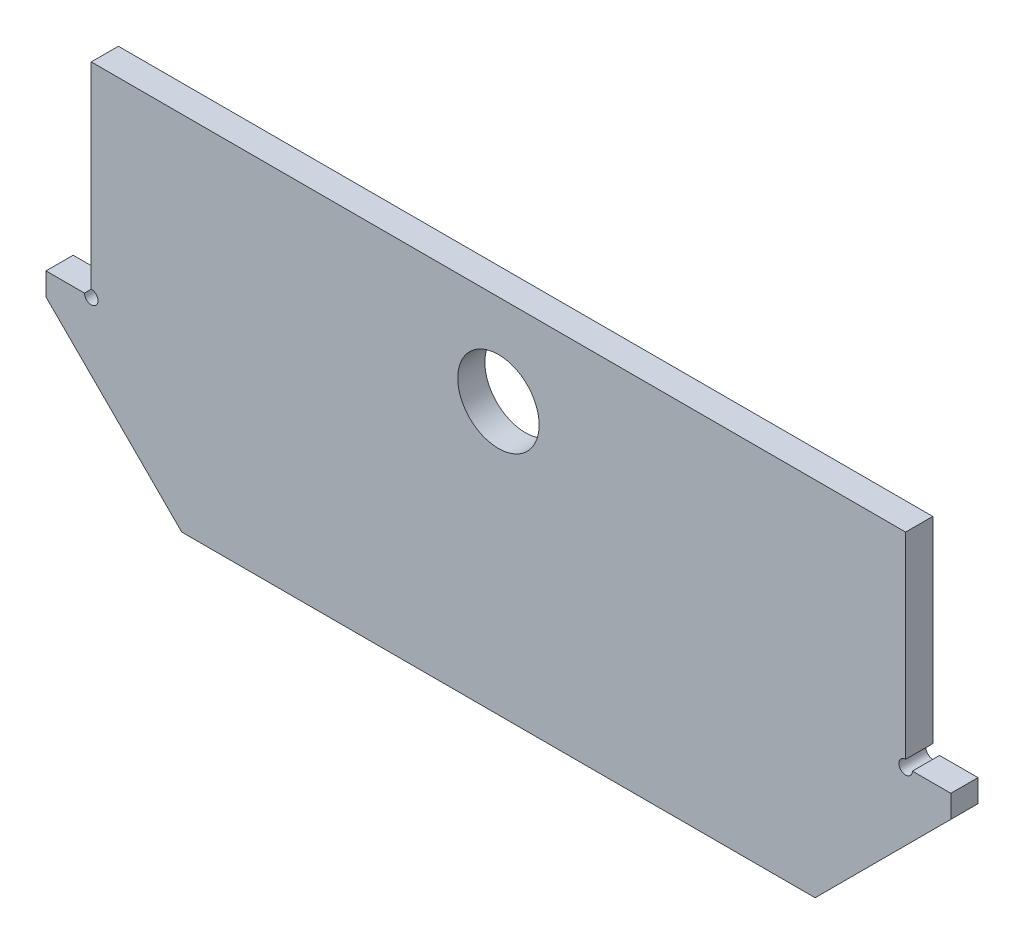
ISO-10303-21;
HEADER;
FILE_DESCRIPTION(('STEP AP214'),'2;1');
FILE_NAME('part.step','',(''),(''),'','','');
FILE_SCHEMA(('AUTOMOTIVE_DESIGN { 1 0 10303 214 1 1 1 1 }'));
ENDSEC;
DATA;
#1=APPLICATION_CONTEXT('core data for automotive mechanical design processes');
#2=APPLICATION_PROTOCOL_DEFINITION('international standard','automotive_design',2000,#1);
#3=PRODUCT_CONTEXT('',#1,'mechanical');
#4=PRODUCT('Part','Part','',(#3));
#5=PRODUCT_RELATED_PRODUCT_CATEGORY('part','',(#4));
#6=PRODUCT_DEFINITION_FORMATION('','',#4);
#7=PRODUCT_DEFINITION_CONTEXT('part definition',#1,'design');
#8=PRODUCT_DEFINITION('design','',#6,#7);
#9=PRODUCT_DEFINITION_SHAPE('','',#8);
#10=(LENGTH_UNIT() NAMED_UNIT(*) SI_UNIT(.MILLI.,.METRE.));
#11=(NAMED_UNIT(*) PLANE_ANGLE_UNIT() SI_UNIT($,.RADIAN.));
#12=(NAMED_UNIT(*) SI_UNIT($,.STERADIAN.) SOLID_ANGLE_UNIT());
#13=UNCERTAINTY_MEASURE_WITH_UNIT(LENGTH_MEASURE(1.E-05),#10,'distance_accuracy_value','');
#14=(GEOMETRIC_REPRESENTATION_CONTEXT(3) GLOBAL_UNCERTAINTY_ASSIGNED_CONTEXT((#13)) GLOBAL_UNIT_ASSIGNED_CONTEXT((#10,
#11,#12)) REPRESENTATION_CONTEXT('',''));
#15=CARTESIAN_POINT('',(0.,0.,0.));
#16=DIRECTION('',(0.,0.,1.));
#17=DIRECTION('',(1.,0.,0.));
#18=AXIS2_PLACEMENT_3D('',#15,#16,#17);
#19=CARTESIAN_POINT('',(-99.9999999999998,-1414.,-3.));
#20=DIRECTION('',(0.,1.,0.));
#21=DIRECTION('',(0.,0.,1.));
#22=AXIS2_PLACEMENT_3D('',#19,#20,#21);
#23=PLANE('',#22);
#24=DIRECTION('',(0.,0.,1.));
#25=VECTOR('',#24,1.);
#26=CARTESIAN_POINT('',(-91.4999999999998,-1414.,-3.));
#27=LINE('',#26,#25);
#28=CARTESIAN_POINT('',(-91.4999999999998,-1414.,-3.));
#29=VERTEX_POINT('',#28);
#30=CARTESIAN_POINT('',(-91.4999999999998,-1414.,3.));
#31=VERTEX_POINT('',#30);
#32=EDGE_CURVE('E60',#29,#31,#27,.T.);
#33=ORIENTED_EDGE('',*,*,#32,.F.);
#34=DIRECTION('',(-1.,0.,0.));
#35=VECTOR('',#34,1.);
#36=CARTESIAN_POINT('',(-99.9999999999998,-1414.,-3.));
#37=LINE('',#36,#35);
#38=CARTESIAN_POINT('',(-99.9999999999998,-1414.,-3.));
#39=VERTEX_POINT('',#38);
#40=EDGE_CURVE('E245',#29,#39,#37,.T.);
#41=ORIENTED_EDGE('',*,*,#40,.T.);
#42=DIRECTION('',(0.,0.,1.));
#43=VECTOR('',#42,1.);
#44=CARTESIAN_POINT('',(-99.9999999999998,-1414.,-3.));
#45=LINE('',#44,#43);
#46=CARTESIAN_POINT('',(-99.9999999999998,-1414.,3.));
#47=VERTEX_POINT('',#46);
#48=EDGE_CURVE('E168',#39,#47,#45,.T.);
#49=ORIENTED_EDGE('',*,*,#48,.T.);
#50=DIRECTION('',(-1.,0.,0.));
#51=VECTOR('',#50,1.);
#52=CARTESIAN_POINT('',(-99.9999999999998,-1414.,3.));
#53=LINE('',#52,#51);
#54=EDGE_CURVE('E196',#31,#47,#53,.T.);
#55=ORIENTED_EDGE('',*,*,#54,.F.);
#56=EDGE_LOOP('',(#33,#41,#49,#55));
#57=FACE_BOUND('',#56,.T.);
#58=ADVANCED_FACE('F38',(#57),#23,.T.);
#59=CARTESIAN_POINT('',(-90.,-1414.,-3.));
#60=DIRECTION('',(-1.,0.,0.));
#61=DIRECTION('',(0.,0.,1.));
#62=AXIS2_PLACEMENT_3D('',#59,#60,#61);
#63=PLANE('',#62);
#64=DIRECTION('',(0.,0.,1.));
#65=VECTOR('',#64,1.);
#66=CARTESIAN_POINT('',(-90.,-1412.5,-3.));
#67=LINE('',#66,#65);
#68=CARTESIAN_POINT('',(-90.,-1412.5,3.));
#69=VERTEX_POINT('',#68);
#70=CARTESIAN_POINT('',(-90.,-1412.5,-3.));
#71=VERTEX_POINT('',#70);
#72=EDGE_CURVE('E205',#69,#71,#67,.F.);
#73=ORIENTED_EDGE('',*,*,#72,.F.);
#74=DIRECTION('',(0.,-1.,0.));
#75=VECTOR('',#74,1.);
#76=CARTESIAN_POINT('',(-90.,-1414.,3.));
#77=LINE('',#76,#75);
#78=CARTESIAN_POINT('',(-90.,-1369.,3.));
#79=VERTEX_POINT('',#78);
#80=EDGE_CURVE('E228',#79,#69,#77,.T.);
#81=ORIENTED_EDGE('',*,*,#80,.F.);
#82=DIRECTION('',(0.,0.,1.));
#83=VECTOR('',#82,1.);
#84=CARTESIAN_POINT('',(-90.,-1369.,-3.));
#85=LINE('',#84,#83);
#86=CARTESIAN_POINT('',(-90.,-1369.,-3.));
#87=VERTEX_POINT('',#86);
#88=EDGE_CURVE('E169',#87,#79,#85,.T.);
#89=ORIENTED_EDGE('',*,*,#88,.F.);
#90=DIRECTION('',(0.,-1.,0.));
#91=VECTOR('',#90,1.);
#92=CARTESIAN_POINT('',(-90.,-1414.,-3.));
#93=LINE('',#92,#91);
#94=EDGE_CURVE('E164',#87,#71,#93,.T.);
#95=ORIENTED_EDGE('',*,*,#94,.T.);
#96=EDGE_LOOP('',(#73,#81,#89,#95));
#97=FACE_BOUND('',#96,.T.);
#98=ADVANCED_FACE('F299',(#97),#63,.T.);
#99=CARTESIAN_POINT('',(-90.,-1369.,-3.));
#100=DIRECTION('',(0.,1.,0.));
#101=DIRECTION('',(0.,0.,1.));
#102=AXIS2_PLACEMENT_3D('',#99,#100,#101);
#103=PLANE('',#102);
#104=ORIENTED_EDGE('',*,*,#88,.T.);
#105=DIRECTION('',(-1.,0.,0.));
#106=VECTOR('',#105,1.);
#107=CARTESIAN_POINT('',(-90.,-1369.,3.));
#108=LINE('',#107,#106);
#109=CARTESIAN_POINT('',(90.0000000000003,-1369.,3.));
#110=VERTEX_POINT('',#109);
#111=EDGE_CURVE('E202',#110,#79,#108,.T.);
#112=ORIENTED_EDGE('',*,*,#111,.F.);
#113=DIRECTION('',(0.,0.,1.));
#114=VECTOR('',#113,1.);
#115=CARTESIAN_POINT('',(90.0000000000003,-1369.,-3.));
#116=LINE('',#115,#114);
#117=CARTESIAN_POINT('',(90.0000000000003,-1369.,-3.));
#118=VERTEX_POINT('',#117);
#119=EDGE_CURVE('E172',#118,#110,#116,.T.);
#120=ORIENTED_EDGE('',*,*,#119,.F.);
#121=DIRECTION('',(-1.,0.,0.));
#122=VECTOR('',#121,1.);
#123=CARTESIAN_POINT('',(-90.,-1369.,-3.));
#124=LINE('',#123,#122);
#125=EDGE_CURVE('E154',#118,#87,#124,.T.);
#126=ORIENTED_EDGE('',*,*,#125,.T.);
#127=EDGE_LOOP('',(#104,#112,#120,#126));
#128=FACE_BOUND('',#127,.T.);
#129=ADVANCED_FACE('F303',(#128),#103,.T.);
#130=CARTESIAN_POINT('',(90.0000000000003,-1414.,-3.));
#131=DIRECTION('',(1.,0.,0.));
#132=DIRECTION('',(0.,0.,-1.));
#133=AXIS2_PLACEMENT_3D('',#130,#131,#132);
#134=PLANE('',#133);
#135=DIRECTION('',(0.,0.,1.));
#136=VECTOR('',#135,1.);
#137=CARTESIAN_POINT('',(90.0000000000003,-1412.5,-3.));
#138=LINE('',#137,#136);
#139=CARTESIAN_POINT('',(90.0000000000003,-1412.5,-3.));
#140=VERTEX_POINT('',#139);
#141=CARTESIAN_POINT('',(90.0000000000003,-1412.5,3.));
#142=VERTEX_POINT('',#141);
#143=EDGE_CURVE('E53',#140,#142,#138,.T.);
#144=ORIENTED_EDGE('',*,*,#143,.F.);
#145=DIRECTION('',(0.,1.,0.));
#146=VECTOR('',#145,1.);
#147=CARTESIAN_POINT('',(90.0000000000003,-1414.,-3.));
#148=LINE('',#147,#146);
#149=EDGE_CURVE('E144',#140,#118,#148,.T.);
#150=ORIENTED_EDGE('',*,*,#149,.T.);
#151=ORIENTED_EDGE('',*,*,#119,.T.);
#152=DIRECTION('',(0.,1.,0.));
#153=VECTOR('',#152,1.);
#154=CARTESIAN_POINT('',(90.0000000000003,-1414.,3.));
#155=LINE('',#154,#153);
#156=EDGE_CURVE('E200',#142,#110,#155,.T.);
#157=ORIENTED_EDGE('',*,*,#156,.F.);
#158=EDGE_LOOP('',(#144,#150,#151,#157));
#159=FACE_BOUND('',#158,.T.);
#160=ADVANCED_FACE('F296',(#159),#134,.T.);
#161=CARTESIAN_POINT('',(90.0000000000003,-1414.,-3.));
#162=DIRECTION('',(0.,1.,0.));
#163=DIRECTION('',(0.,0.,1.));
#164=AXIS2_PLACEMENT_3D('',#161,#162,#163);
#165=PLANE('',#164);
#166=DIRECTION('',(0.,0.,1.));
#167=VECTOR('',#166,1.);
#168=CARTESIAN_POINT('',(91.5000000000002,-1414.,-3.));
#169=LINE('',#168,#167);
#170=CARTESIAN_POINT('',(91.5000000000002,-1414.,3.));
#171=VERTEX_POINT('',#170);
#172=CARTESIAN_POINT('',(91.5000000000002,-1414.,-3.));
#173=VERTEX_POINT('',#172);
#174=EDGE_CURVE('E124',#171,#173,#169,.F.);
#175=ORIENTED_EDGE('',*,*,#174,.F.);
#176=DIRECTION('',(-1.,0.,0.));
#177=VECTOR('',#176,1.);
#178=CARTESIAN_POINT('',(90.0000000000003,-1414.,3.));
#179=LINE('',#178,#177);
#180=CARTESIAN_POINT('',(100.,-1414.,3.));
#181=VERTEX_POINT('',#180);
#182=EDGE_CURVE('E203',#181,#171,#179,.T.);
#183=ORIENTED_EDGE('',*,*,#182,.F.);
#184=DIRECTION('',(0.,0.,1.));
#185=VECTOR('',#184,1.);
#186=CARTESIAN_POINT('',(100.,-1414.,-3.));
#187=LINE('',#186,#185);
#188=CARTESIAN_POINT('',(100.,-1414.,-3.));
#189=VERTEX_POINT('',#188);
#190=EDGE_CURVE('E148',#189,#181,#187,.T.);
#191=ORIENTED_EDGE('',*,*,#190,.F.);
#192=DIRECTION('',(-1.,0.,0.));
#193=VECTOR('',#192,1.);
#194=CARTESIAN_POINT('',(90.0000000000003,-1414.,-3.));
#195=LINE('',#194,#193);
#196=EDGE_CURVE('E141',#189,#173,#195,.T.);
#197=ORIENTED_EDGE('',*,*,#196,.T.);
#198=EDGE_LOOP('',(#175,#183,#191,#197));
#199=FACE_BOUND('',#198,.T.);
#200=ADVANCED_FACE('F147',(#199),#165,.T.);
#201=CARTESIAN_POINT('',(100.,-1414.,-3.));
#202=DIRECTION('',(1.,0.,0.));
#203=DIRECTION('',(0.,0.,-1.));
#204=AXIS2_PLACEMENT_3D('',#201,#202,#203);
#205=PLANE('',#204);
#206=ORIENTED_EDGE('',*,*,#190,.T.);
#207=DIRECTION('',(0.,1.,0.));
#208=VECTOR('',#207,1.);
#209=CARTESIAN_POINT('',(100.,-1414.,3.));
#210=LINE('',#209,#208);
#211=CARTESIAN_POINT('',(100.,-1419.,3.));
#212=VERTEX_POINT('',#211);
#213=EDGE_CURVE('E223',#212,#181,#210,.T.);
#214=ORIENTED_EDGE('',*,*,#213,.F.);
#215=DIRECTION('',(0.,0.,1.));
#216=VECTOR('',#215,1.);
#217=CARTESIAN_POINT('',(100.,-1419.,-3.));
#218=LINE('',#217,#216);
#219=CARTESIAN_POINT('',(100.,-1419.,-3.));
#220=VERTEX_POINT('',#219);
#221=EDGE_CURVE('E178',#220,#212,#218,.T.);
#222=ORIENTED_EDGE('',*,*,#221,.F.);
#223=DIRECTION('',(0.,1.,0.));
#224=VECTOR('',#223,1.);
#225=CARTESIAN_POINT('',(100.,-1414.,-3.));
#226=LINE('',#225,#224);
#227=EDGE_CURVE('E150',#220,#189,#226,.T.);
#228=ORIENTED_EDGE('',*,*,#227,.T.);
#229=EDGE_LOOP('',(#206,#214,#222,#228));
#230=FACE_BOUND('',#229,.T.);
#231=ADVANCED_FACE('F288',(#230),#205,.T.);
#232=CARTESIAN_POINT('',(70.0000000000002,-1449.,-3.));
#233=DIRECTION('',(0.707106781186548,-0.707106781186547,0.));
#234=DIRECTION('',(0.707106781186547,0.707106781186548,0.));
#235=AXIS2_PLACEMENT_3D('',#232,#233,#234);
#236=PLANE('',#235);
#237=ORIENTED_EDGE('',*,*,#221,.T.);
#238=DIRECTION('',(0.707106781186547,0.707106781186548,0.));
#239=VECTOR('',#238,1.);
#240=CARTESIAN_POINT('',(70.0000000000002,-1449.,3.));
#241=LINE('',#240,#239);
#242=CARTESIAN_POINT('',(70.0000000000002,-1449.,3.));
#243=VERTEX_POINT('',#242);
#244=EDGE_CURVE('E211',#243,#212,#241,.T.);
#245=ORIENTED_EDGE('',*,*,#244,.F.);
#246=DIRECTION('',(0.,0.,1.));
#247=VECTOR('',#246,1.);
#248=CARTESIAN_POINT('',(70.0000000000002,-1449.,-3.));
#249=LINE('',#248,#247);
#250=CARTESIAN_POINT('',(70.0000000000002,-1449.,-3.));
#251=VERTEX_POINT('',#250);
#252=EDGE_CURVE('E181',#251,#243,#249,.T.);
#253=ORIENTED_EDGE('',*,*,#252,.F.);
#254=DIRECTION('',(0.707106781186547,0.707106781186548,0.));
#255=VECTOR('',#254,1.);
#256=CARTESIAN_POINT('',(70.0000000000002,-1449.,-3.));
#257=LINE('',#256,#255);
#258=EDGE_CURVE('E157',#251,#220,#257,.T.);
#259=ORIENTED_EDGE('',*,*,#258,.T.);
#260=EDGE_LOOP('',(#237,#245,#253,#259));
#261=FACE_BOUND('',#260,.T.);
#262=ADVANCED_FACE('F282',(#261),#236,.T.);
#263=CARTESIAN_POINT('',(-69.9999999999998,-1449.,-3.));
#264=DIRECTION('',(0.,-1.,0.));
#265=DIRECTION('',(0.,0.,-1.));
#266=AXIS2_PLACEMENT_3D('',#263,#264,#265);
#267=PLANE('',#266);
#268=ORIENTED_EDGE('',*,*,#252,.T.);
#269=DIRECTION('',(1.,0.,0.));
#270=VECTOR('',#269,1.);
#271=CARTESIAN_POINT('',(-69.9999999999998,-1449.,3.));
#272=LINE('',#271,#270);
#273=CARTESIAN_POINT('',(-69.9999999999998,-1449.,3.));
#274=VERTEX_POINT('',#273);
#275=EDGE_CURVE('E208',#274,#243,#272,.T.);
#276=ORIENTED_EDGE('',*,*,#275,.F.);
#277=DIRECTION('',(0.,0.,1.));
#278=VECTOR('',#277,1.);
#279=CARTESIAN_POINT('',(-69.9999999999998,-1449.,-3.));
#280=LINE('',#279,#278);
#281=CARTESIAN_POINT('',(-69.9999999999998,-1449.,-3.));
#282=VERTEX_POINT('',#281);
#283=EDGE_CURVE('E184',#282,#274,#280,.T.);
#284=ORIENTED_EDGE('',*,*,#283,.F.);
#285=DIRECTION('',(1.,0.,0.));
#286=VECTOR('',#285,1.);
#287=CARTESIAN_POINT('',(-69.9999999999998,-1449.,-3.));
#288=LINE('',#287,#286);
#289=EDGE_CURVE('E216',#282,#251,#288,.T.);
#290=ORIENTED_EDGE('',*,*,#289,.T.);
#291=EDGE_LOOP('',(#268,#276,#284,#290));
#292=FACE_BOUND('',#291,.T.);
#293=ADVANCED_FACE('F285',(#292),#267,.T.);
#294=CARTESIAN_POINT('',(-99.9999999999998,-1419.,-3.));
#295=DIRECTION('',(-0.707106781186548,-0.707106781186547,0.));
#296=DIRECTION('',(0.707106781186547,-0.707106781186548,0.));
#297=AXIS2_PLACEMENT_3D('',#294,#295,#296);
#298=PLANE('',#297);
#299=ORIENTED_EDGE('',*,*,#283,.T.);
#300=DIRECTION('',(0.707106781186547,-0.707106781186548,0.));
#301=VECTOR('',#300,1.);
#302=CARTESIAN_POINT('',(-99.9999999999998,-1419.,3.));
#303=LINE('',#302,#301);
#304=CARTESIAN_POINT('',(-99.9999999999998,-1419.,3.));
#305=VERTEX_POINT('',#304);
#306=EDGE_CURVE('E212',#305,#274,#303,.T.);
#307=ORIENTED_EDGE('',*,*,#306,.F.);
#308=DIRECTION('',(0.,0.,1.));
#309=VECTOR('',#308,1.);
#310=CARTESIAN_POINT('',(-99.9999999999998,-1419.,-3.));
#311=LINE('',#310,#309);
#312=CARTESIAN_POINT('',(-99.9999999999998,-1419.,-3.));
#313=VERTEX_POINT('',#312);
#314=EDGE_CURVE('E187',#313,#305,#311,.T.);
#315=ORIENTED_EDGE('',*,*,#314,.F.);
#316=DIRECTION('',(0.707106781186547,-0.707106781186548,0.));
#317=VECTOR('',#316,1.);
#318=CARTESIAN_POINT('',(-99.9999999999998,-1419.,-3.));
#319=LINE('',#318,#317);
#320=EDGE_CURVE('E217',#313,#282,#319,.T.);
#321=ORIENTED_EDGE('',*,*,#320,.T.);
#322=EDGE_LOOP('',(#299,#307,#315,#321));
#323=FACE_BOUND('',#322,.T.);
#324=ADVANCED_FACE('F279',(#323),#298,.T.);
#325=CARTESIAN_POINT('',(-99.9999999999998,-1414.,-3.));
#326=DIRECTION('',(-1.,0.,0.));
#327=DIRECTION('',(0.,0.,1.));
#328=AXIS2_PLACEMENT_3D('',#325,#326,#327);
#329=PLANE('',#328);
#330=ORIENTED_EDGE('',*,*,#314,.T.);
#331=DIRECTION('',(0.,-1.,0.));
#332=VECTOR('',#331,1.);
#333=CARTESIAN_POINT('',(-99.9999999999998,-1414.,3.));
#334=LINE('',#333,#332);
#335=EDGE_CURVE('E259',#47,#305,#334,.T.);
#336=ORIENTED_EDGE('',*,*,#335,.F.);
#337=ORIENTED_EDGE('',*,*,#48,.F.);
#338=DIRECTION('',(0.,-1.,0.));
#339=VECTOR('',#338,1.);
#340=CARTESIAN_POINT('',(-99.9999999999998,-1414.,-3.));
#341=LINE('',#340,#339);
#342=EDGE_CURVE('E219',#39,#313,#341,.T.);
#343=ORIENTED_EDGE('',*,*,#342,.T.);
#344=EDGE_LOOP('',(#330,#336,#337,#343));
#345=FACE_BOUND('',#344,.T.);
#346=ADVANCED_FACE('F276',(#345),#329,.T.);
#347=CARTESIAN_POINT('',(0.,0.,-3.));
#348=DIRECTION('',(0.,0.,1.));
#349=DIRECTION('',(1.,0.,0.));
#350=AXIS2_PLACEMENT_3D('',#347,#348,#349);
#351=PLANE('',#350);
#352=CARTESIAN_POINT('',(7.45777626196619E-13,-1389.,-3.));
#353=DIRECTION('',(0.,0.,1.));
#354=DIRECTION('',(1.,0.,0.));
#355=AXIS2_PLACEMENT_3D('',#352,#353,#354);
#356=CIRCLE('',#355,9.00000000000002);
#357=CARTESIAN_POINT('',(9.00000000000077,-1389.,-3.));
#358=VERTEX_POINT('',#357);
#359=EDGE_CURVE('E197',#358,#358,#356,.T.);
#360=ORIENTED_EDGE('',*,*,#359,.T.);
#361=EDGE_LOOP('',(#360));
#362=FACE_BOUND('',#361,.T.);
#363=ORIENTED_EDGE('',*,*,#40,.F.);
#364=CARTESIAN_POINT('',(-90.,-1414.,-3.));
#365=DIRECTION('',(0.,0.,1.));
#366=DIRECTION('',(1.,0.,0.));
#367=AXIS2_PLACEMENT_3D('',#364,#365,#366);
#368=CIRCLE('',#367,1.49999999999985);
#369=EDGE_CURVE('E133',#29,#71,#368,.T.);
#370=ORIENTED_EDGE('',*,*,#369,.T.);
#371=ORIENTED_EDGE('',*,*,#94,.F.);
#372=ORIENTED_EDGE('',*,*,#125,.F.);
#373=ORIENTED_EDGE('',*,*,#149,.F.);
#374=CARTESIAN_POINT('',(90.0000000000003,-1414.,-3.));
#375=DIRECTION('',(0.,0.,1.));
#376=DIRECTION('',(1.,0.,0.));
#377=AXIS2_PLACEMENT_3D('',#374,#375,#376);
#378=CIRCLE('',#377,1.49999999999985);
#379=EDGE_CURVE('E127',#140,#173,#378,.T.);
#380=ORIENTED_EDGE('',*,*,#379,.T.);
#381=ORIENTED_EDGE('',*,*,#196,.F.);
#382=ORIENTED_EDGE('',*,*,#227,.F.);
#383=ORIENTED_EDGE('',*,*,#258,.F.);
#384=ORIENTED_EDGE('',*,*,#289,.F.);
#385=ORIENTED_EDGE('',*,*,#320,.F.);
#386=ORIENTED_EDGE('',*,*,#342,.F.);
#387=EDGE_LOOP('',(#363,#370,#371,#372,#373,#380,#381,#382,#383,#384,#385,#386));
#388=FACE_BOUND('',#387,.T.);
#389=ADVANCED_FACE('F139',(#362,#388),#351,.F.);
#390=CARTESIAN_POINT('',(0.,0.,3.));
#391=DIRECTION('',(0.,0.,1.));
#392=DIRECTION('',(1.,0.,0.));
#393=AXIS2_PLACEMENT_3D('',#390,#391,#392);
#394=PLANE('',#393);
#395=CARTESIAN_POINT('',(-90.,-1414.,3.));
#396=DIRECTION('',(0.,0.,1.));
#397=DIRECTION('',(1.,0.,0.));
#398=AXIS2_PLACEMENT_3D('',#395,#396,#397);
#399=CIRCLE('',#398,1.49999999999985);
#400=EDGE_CURVE('E11',#31,#69,#399,.T.);
#401=ORIENTED_EDGE('',*,*,#400,.F.);
#402=ORIENTED_EDGE('',*,*,#54,.T.);
#403=ORIENTED_EDGE('',*,*,#335,.T.);
#404=ORIENTED_EDGE('',*,*,#306,.T.);
#405=ORIENTED_EDGE('',*,*,#275,.T.);
#406=ORIENTED_EDGE('',*,*,#244,.T.);
#407=ORIENTED_EDGE('',*,*,#213,.T.);
#408=ORIENTED_EDGE('',*,*,#182,.T.);
#409=CARTESIAN_POINT('',(90.0000000000003,-1414.,3.));
#410=DIRECTION('',(0.,0.,1.));
#411=DIRECTION('',(1.,0.,0.));
#412=AXIS2_PLACEMENT_3D('',#409,#410,#411);
#413=CIRCLE('',#412,1.49999999999985);
#414=EDGE_CURVE('E46',#142,#171,#413,.T.);
#415=ORIENTED_EDGE('',*,*,#414,.F.);
#416=ORIENTED_EDGE('',*,*,#156,.T.);
#417=ORIENTED_EDGE('',*,*,#111,.T.);
#418=ORIENTED_EDGE('',*,*,#80,.T.);
#419=EDGE_LOOP('',(#401,#402,#403,#404,#405,#406,#407,#408,#415,#416,#417,#418));
#420=FACE_BOUND('',#419,.T.);
#421=CARTESIAN_POINT('',(7.45777626196619E-13,-1389.,3.));
#422=DIRECTION('',(0.,0.,1.));
#423=DIRECTION('',(1.,0.,0.));
#424=AXIS2_PLACEMENT_3D('',#421,#422,#423);
#425=CIRCLE('',#424,9.00000000000002);
#426=CARTESIAN_POINT('',(9.00000000000077,-1389.,3.));
#427=VERTEX_POINT('',#426);
#428=EDGE_CURVE('E193',#427,#427,#425,.T.);
#429=ORIENTED_EDGE('',*,*,#428,.F.);
#430=EDGE_LOOP('',(#429));
#431=FACE_BOUND('',#430,.T.);
#432=ADVANCED_FACE('F268',(#420,#431),#394,.T.);
#433=CARTESIAN_POINT('',(7.45777626196619E-13,-1389.,-3.));
#434=DIRECTION('',(0.,0.,1.));
#435=DIRECTION('',(1.,0.,0.));
#436=AXIS2_PLACEMENT_3D('',#433,#434,#435);
#437=CYLINDRICAL_SURFACE('',#436,9.00000000000002);
#438=ORIENTED_EDGE('',*,*,#428,.T.);
#439=EDGE_LOOP('',(#438));
#440=FACE_BOUND('',#439,.T.);
#441=ORIENTED_EDGE('',*,*,#359,.F.);
#442=EDGE_LOOP('',(#441));
#443=FACE_BOUND('',#442,.T.);
#444=ADVANCED_FACE('F330',(#440,#443),#437,.F.);
#445=CARTESIAN_POINT('',(90.0000000000003,-1414.,-3.));
#446=DIRECTION('',(0.,0.,1.));
#447=DIRECTION('',(1.,0.,0.));
#448=AXIS2_PLACEMENT_3D('',#445,#446,#447);
#449=CYLINDRICAL_SURFACE('',#448,1.49999999999985);
#450=ORIENTED_EDGE('',*,*,#143,.T.);
#451=ORIENTED_EDGE('',*,*,#414,.T.);
#452=ORIENTED_EDGE('',*,*,#174,.T.);
#453=ORIENTED_EDGE('',*,*,#379,.F.);
#454=EDGE_LOOP('',(#450,#451,#452,#453));
#455=FACE_BOUND('',#454,.T.);
#456=ADVANCED_FACE('F126',(#455),#449,.F.);
#457=CARTESIAN_POINT('',(-90.,-1414.,-3.));
#458=DIRECTION('',(0.,0.,1.));
#459=DIRECTION('',(1.,0.,0.));
#460=AXIS2_PLACEMENT_3D('',#457,#458,#459);
#461=CYLINDRICAL_SURFACE('',#460,1.49999999999985);
#462=ORIENTED_EDGE('',*,*,#32,.T.);
#463=ORIENTED_EDGE('',*,*,#400,.T.);
#464=ORIENTED_EDGE('',*,*,#72,.T.);
#465=ORIENTED_EDGE('',*,*,#369,.F.);
#466=EDGE_LOOP('',(#462,#463,#464,#465));
#467=FACE_BOUND('',#466,.T.);
#468=ADVANCED_FACE('F324',(#467),#461,.F.);
#469=CLOSED_SHELL('',(#58,#98,#129,#160,#200,#231,#262,#293,#324,#346,#389,#432,#444,#456,#468));
#470=MANIFOLD_SOLID_BREP('B2',#469);
#471=ADVANCED_BREP_SHAPE_REPRESENTATION('',(#18,#470),#14);
#472=SHAPE_DEFINITION_REPRESENTATION(#9,#471);
ENDSEC;
END-ISO-10303-21;
